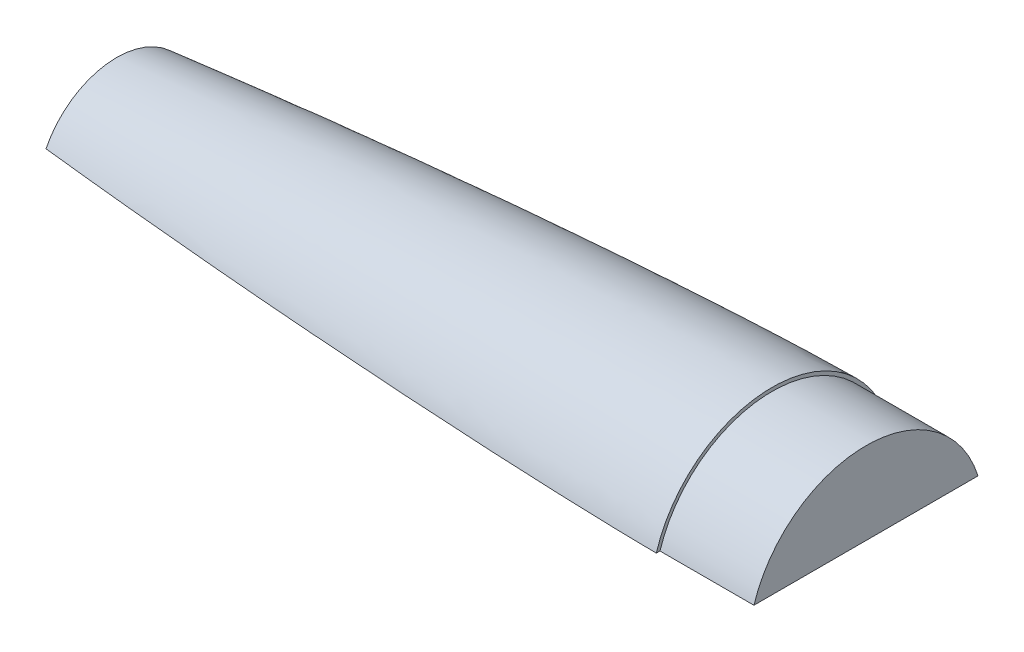
ISO-10303-21;
HEADER;
FILE_DESCRIPTION(('STEP AP214'),'2;1');
FILE_NAME('part.step','',(''),(''),'','','');
FILE_SCHEMA(('AUTOMOTIVE_DESIGN { 1 0 10303 214 1 1 1 1 }'));
ENDSEC;
DATA;
#1=APPLICATION_CONTEXT('core data for automotive mechanical design processes');
#2=APPLICATION_PROTOCOL_DEFINITION('international standard','automotive_design',2000,#1);
#3=PRODUCT_CONTEXT('',#1,'mechanical');
#4=PRODUCT('Part','Part','',(#3));
#5=PRODUCT_RELATED_PRODUCT_CATEGORY('part','',(#4));
#6=PRODUCT_DEFINITION_FORMATION('','',#4);
#7=PRODUCT_DEFINITION_CONTEXT('part definition',#1,'design');
#8=PRODUCT_DEFINITION('design','',#6,#7);
#9=PRODUCT_DEFINITION_SHAPE('','',#8);
#10=(LENGTH_UNIT() NAMED_UNIT(*) SI_UNIT(.MILLI.,.METRE.));
#11=(NAMED_UNIT(*) PLANE_ANGLE_UNIT() SI_UNIT($,.RADIAN.));
#12=(NAMED_UNIT(*) SI_UNIT($,.STERADIAN.) SOLID_ANGLE_UNIT());
#13=UNCERTAINTY_MEASURE_WITH_UNIT(LENGTH_MEASURE(1.E-05),#10,'distance_accuracy_value','');
#14=(GEOMETRIC_REPRESENTATION_CONTEXT(3) GLOBAL_UNCERTAINTY_ASSIGNED_CONTEXT((#13)) GLOBAL_UNIT_ASSIGNED_CONTEXT((#10,
#11,#12)) REPRESENTATION_CONTEXT('',''));
#15=CARTESIAN_POINT('',(0.,0.,0.));
#16=DIRECTION('',(0.,0.,1.));
#17=DIRECTION('',(1.,0.,0.));
#18=AXIS2_PLACEMENT_3D('',#15,#16,#17);
#19=CARTESIAN_POINT('',(685.8,63.5,0.));
#20=DIRECTION('',(-1.,0.,0.));
#21=DIRECTION('',(0.,0.,1.));
#22=AXIS2_PLACEMENT_3D('',#19,#20,#21);
#23=PLANE('',#22);
#24=DIRECTION('',(0.,0.,-1.));
#25=VECTOR('',#24,1.);
#26=CARTESIAN_POINT('',(685.8,19.05,0.));
#27=LINE('',#26,#25);
#28=CARTESIAN_POINT('',(685.8,19.05,60.5751392899761));
#29=VERTEX_POINT('',#28);
#30=CARTESIAN_POINT('',(685.8,19.05,-60.5751392899761));
#31=VERTEX_POINT('',#30);
#32=EDGE_CURVE('E80',#29,#31,#27,.T.);
#33=ORIENTED_EDGE('',*,*,#32,.T.);
#34=CARTESIAN_POINT('',(685.8,0.,0.));
#35=DIRECTION('',(-1.,0.,0.));
#36=DIRECTION('',(0.,0.,1.));
#37=AXIS2_PLACEMENT_3D('',#34,#35,#36);
#38=CIRCLE('',#37,63.5);
#39=EDGE_CURVE('E90',#29,#31,#38,.T.);
#40=ORIENTED_EDGE('',*,*,#39,.F.);
#41=EDGE_LOOP('',(#33,#40));
#42=FACE_BOUND('',#41,.T.);
#43=ADVANCED_FACE('F41',(#42),#23,.F.);
#44=CARTESIAN_POINT('',(0.,0.,0.));
#45=DIRECTION('',(-1.,0.,0.));
#46=DIRECTION('',(0.,0.,1.));
#47=AXIS2_PLACEMENT_3D('',#44,#45,#46);
#48=CYLINDRICAL_SURFACE('',#47,63.5);
#49=DIRECTION('',(-1.,0.,0.));
#50=VECTOR('',#49,1.);
#51=CARTESIAN_POINT('',(0.,19.05,60.5751392899761));
#52=LINE('',#51,#50);
#53=CARTESIAN_POINT('',(635.,19.05,60.5751392899761));
#54=VERTEX_POINT('',#53);
#55=EDGE_CURVE('E83',#29,#54,#52,.T.);
#56=ORIENTED_EDGE('',*,*,#55,.F.);
#57=ORIENTED_EDGE('',*,*,#39,.T.);
#58=DIRECTION('',(-1.,0.,0.));
#59=VECTOR('',#58,1.);
#60=CARTESIAN_POINT('',(0.,19.05,-60.5751392899761));
#61=LINE('',#60,#59);
#62=CARTESIAN_POINT('',(635.,19.05,-60.5751392899761));
#63=VERTEX_POINT('',#62);
#64=EDGE_CURVE('E86',#63,#31,#61,.F.);
#65=ORIENTED_EDGE('',*,*,#64,.F.);
#66=CARTESIAN_POINT('',(635.,0.,0.));
#67=DIRECTION('',(-1.,0.,0.));
#68=DIRECTION('',(0.,0.,1.));
#69=AXIS2_PLACEMENT_3D('',#66,#67,#68);
#70=CIRCLE('',#69,63.5);
#71=EDGE_CURVE('E96',#54,#63,#70,.T.);
#72=ORIENTED_EDGE('',*,*,#71,.F.);
#73=EDGE_LOOP('',(#56,#57,#65,#72));
#74=FACE_BOUND('',#73,.T.);
#75=ADVANCED_FACE('F94',(#74),#48,.T.);
#76=CARTESIAN_POINT('',(635.,63.5,0.));
#77=DIRECTION('',(-1.,0.,0.));
#78=DIRECTION('',(0.,0.,1.));
#79=AXIS2_PLACEMENT_3D('',#76,#77,#78);
#80=PLANE('',#79);
#81=DIRECTION('',(0.,0.,1.));
#82=VECTOR('',#81,1.);
#83=CARTESIAN_POINT('',(635.,19.05,0.));
#84=LINE('',#83,#82);
#85=CARTESIAN_POINT('',(635.,19.05,-62.5692538312549));
#86=VERTEX_POINT('',#85);
#87=EDGE_CURVE('E113',#86,#63,#84,.T.);
#88=ORIENTED_EDGE('',*,*,#87,.F.);
#89=CARTESIAN_POINT('',(635.,0.,0.));
#90=DIRECTION('',(-1.,0.,0.));
#91=DIRECTION('',(0.,0.,1.));
#92=AXIS2_PLACEMENT_3D('',#89,#90,#91);
#93=CIRCLE('',#92,65.405);
#94=CARTESIAN_POINT('',(635.,19.05,62.5692538312549));
#95=VERTEX_POINT('',#94);
#96=EDGE_CURVE('E53',#95,#86,#93,.T.);
#97=ORIENTED_EDGE('',*,*,#96,.F.);
#98=EDGE_CURVE('E97',#54,#95,#84,.T.);
#99=ORIENTED_EDGE('',*,*,#98,.F.);
#100=ORIENTED_EDGE('',*,*,#71,.T.);
#101=EDGE_LOOP('',(#88,#97,#99,#100));
#102=FACE_BOUND('',#101,.T.);
#103=ADVANCED_FACE('F120',(#102),#80,.F.);
#104=CARTESIAN_POINT('',(279.4,19.05,0.));
#105=DIRECTION('',(0.,-1.,0.));
#106=DIRECTION('',(0.,0.,-1.));
#107=AXIS2_PLACEMENT_3D('',#104,#105,#106);
#108=PLANE('',#107);
#109=DIRECTION('',(0.,0.,1.));
#110=VECTOR('',#109,1.);
#111=CARTESIAN_POINT('',(280.67,19.05,0.));
#112=LINE('',#111,#110);
#113=CARTESIAN_POINT('',(280.67,19.05,-38.2205203294032));
#114=VERTEX_POINT('',#113);
#115=CARTESIAN_POINT('',(280.67,19.05,38.2205203294032));
#116=VERTEX_POINT('',#115);
#117=EDGE_CURVE('E11',#114,#116,#112,.T.);
#118=ORIENTED_EDGE('',*,*,#117,.F.);
#119=CARTESIAN_POINT('',(279.4,19.05,-38.0787468146542));
#120=CARTESIAN_POINT('',(281.962941840319,19.05,-38.3653148698022));
#121=CARTESIAN_POINT('',(284.52619313829,19.05,-38.6491115880142));
#122=CARTESIAN_POINT('',(289.653293660425,19.05,-39.2113363491132));
#123=CARTESIAN_POINT('',(292.217142886666,19.05,-39.4897643730632));
#124=CARTESIAN_POINT('',(297.345408497432,19.05,-40.0414246180997));
#125=CARTESIAN_POINT('',(299.909824883765,19.05,-40.3146568223671));
#126=CARTESIAN_POINT('',(305.039196925893,19.05,-40.8560742741887));
#127=CARTESIAN_POINT('',(307.604152583049,19.05,-41.1242595088351));
#128=CARTESIAN_POINT('',(312.734576809965,19.05,-41.6557166548684));
#129=CARTESIAN_POINT('',(315.300045380515,19.05,-41.9189885586175));
#130=CARTESIAN_POINT('',(320.43256951596,19.05,-42.4408488164031));
#131=CARTESIAN_POINT('',(322.999625289811,19.05,-42.6994351150424));
#132=CARTESIAN_POINT('',(328.134202873585,19.05,-43.2119127435085));
#133=CARTESIAN_POINT('',(330.701724683053,19.05,-43.4658040778857));
#134=CARTESIAN_POINT('',(335.837212635562,19.05,-43.9689834624861));
#135=CARTESIAN_POINT('',(338.405178777453,19.05,-44.2182715244462));
#136=CARTESIAN_POINT('',(343.54153487725,19.05,-44.7123260708543));
#137=CARTESIAN_POINT('',(346.109924833278,19.05,-44.9570925748264));
#138=CARTESIAN_POINT('',(351.247108327983,19.05,-45.442174327989));
#139=CARTESIAN_POINT('',(353.815901864041,19.05,-45.6824896049671));
#140=CARTESIAN_POINT('',(363.787335485023,19.05,-46.6067575310501));
#141=CARTESIAN_POINT('',(371.19146531341,19.05,-47.2747110276422));
#142=CARTESIAN_POINT('',(386.002794445674,19.05,-48.5753703209046));
#143=CARTESIAN_POINT('',(393.409993741409,19.05,-49.2080762104911));
#144=CARTESIAN_POINT('',(408.227377777448,19.05,-50.4388371668362));
#145=CARTESIAN_POINT('',(415.637562558885,19.05,-51.0368917385027));
#146=CARTESIAN_POINT('',(430.460863850272,19.05,-52.1984595248306));
#147=CARTESIAN_POINT('',(437.873980441993,19.05,-52.7619716959195));
#148=CARTESIAN_POINT('',(452.703129718263,19.05,-53.8541035393644));
#149=CARTESIAN_POINT('',(460.119162522014,19.05,-54.3827215937465));
#150=CARTESIAN_POINT('',(474.954170880049,19.05,-55.4041802346604));
#151=CARTESIAN_POINT('',(482.373146592318,19.05,-55.8970185287863));
#152=CARTESIAN_POINT('',(497.210334993728,19.05,-56.8451778325824));
#153=CARTESIAN_POINT('',(504.628546670283,19.05,-57.3005146767645));
#154=CARTESIAN_POINT('',(519.467360795622,19.05,-58.1715988116425));
#155=CARTESIAN_POINT('',(526.887963262055,19.05,-58.5873458030278));
#156=CARTESIAN_POINT('',(538.020452451662,19.05,-59.1787057100789));
#157=CARTESIAN_POINT('',(541.731487214648,19.05,-59.3704461142135));
#158=CARTESIAN_POINT('',(549.154126587857,19.05,-59.742543753956));
#159=CARTESIAN_POINT('',(552.865731197695,19.05,-59.9229009972155));
#160=CARTESIAN_POINT('',(560.289270654327,19.05,-60.2714807123018));
#161=CARTESIAN_POINT('',(564.001205464342,19.05,-60.4397039666133));
#162=CARTESIAN_POINT('',(571.425640172957,19.05,-60.7631374828902));
#163=CARTESIAN_POINT('',(575.13814007106,19.05,-60.918347756244));
#164=CARTESIAN_POINT('',(582.563415939562,19.05,-61.2144839827638));
#165=CARTESIAN_POINT('',(586.276191864725,19.05,-61.3554110676676));
#166=CARTESIAN_POINT('',(593.702334555381,19.05,-61.621256096151));
#167=CARTESIAN_POINT('',(597.415701322829,19.05,-61.7461739856221));
#168=CARTESIAN_POINT('',(602.986120615846,19.05,-61.9196907560125));
#169=CARTESIAN_POINT('',(604.842958597213,19.05,-61.9752188844349));
#170=CARTESIAN_POINT('',(608.556780664078,19.05,-62.0812314908967));
#171=CARTESIAN_POINT('',(610.413764749675,19.05,-62.1317159655404));
#172=CARTESIAN_POINT('',(614.127867626814,19.05,-62.2269513241083));
#173=CARTESIAN_POINT('',(615.984986417346,19.05,-62.2717022473751));
#174=CARTESIAN_POINT('',(619.699371030722,19.05,-62.354555813422));
#175=CARTESIAN_POINT('',(621.556636853268,19.05,-62.3926584693033));
#176=CARTESIAN_POINT('',(624.057582839542,19.05,-62.4385699348673));
#177=CARTESIAN_POINT('',(624.701199008142,19.05,-62.4499039832551));
#178=CARTESIAN_POINT('',(625.988449363352,19.05,-62.4715207063014));
#179=CARTESIAN_POINT('',(626.63208354997,19.05,-62.4818033805221));
#180=CARTESIAN_POINT('',(627.919367879378,19.05,-62.5012377844219));
#181=CARTESIAN_POINT('',(628.563018022136,19.05,-62.5103895162302));
#182=CARTESIAN_POINT('',(629.850348049547,19.05,-62.5273219164161));
#183=CARTESIAN_POINT('',(630.494027934528,19.05,-62.5351025601207));
#184=CARTESIAN_POINT('',(631.781409150107,19.05,-62.5488353621133));
#185=CARTESIAN_POINT('',(632.425110480738,19.05,-62.5547875177062));
#186=CARTESIAN_POINT('',(633.712538585411,19.05,-62.5641277274002));
#187=CARTESIAN_POINT('',(634.35626535966,19.05,-62.5675157523067));
#188=CARTESIAN_POINT('',(635.,19.05,-62.5692538312549));
#189=B_SPLINE_CURVE_WITH_KNOTS('',3,(#119,#120,#121,#122,#123,#124,#125,#126,#127,#128,#129,
#130,#131,#132,#133,#134,#135,#136,#137,#138,#139,#140,#141,#142,#143,#144,#145,#146,#147,#148,
#149,#150,#151,#152,#153,#154,#155,#156,#157,#158,#159,#160,#161,#162,#163,#164,#165,#166,#167,
#168,#169,#170,#171,#172,#173,#174,#175,#176,#177,#178,#179,#180,#181,#182,#183,#184,#185,#186,
#187,#188),.UNSPECIFIED.,.F.,.F.,(4,2,2,2,2,2,2,2,2,2,2,2,2,2,2,2,2,2,2,2,2,2,2,2,2,2,2,2,2,2,2,
2,2,2,4),(0.,7.73673681385579,15.4735009123669,23.21029005076,30.9470989733787,38.6839199218791,
46.4240563443367,54.1641852648212,61.9042944476294,69.644370200718,77.3843976186842,
99.6868940302174,121.989331647435,144.292087839578,166.595517496405,188.899980595587,
211.205871480887,233.502295178368,255.798887429798,266.946827872439,278.094760821598,
289.241974230058,300.389177882956,311.535497588225,322.68185496525,328.254853754648,
333.827856296046,339.400820594261,344.973773910144,346.904921137579,348.836069169189,
350.76721356502,352.698392708733,354.629574698889,356.560778676705),.UNSPECIFIED.);
#190=EDGE_CURVE('E100',#114,#86,#189,.T.);
#191=ORIENTED_EDGE('',*,*,#190,.T.);
#192=ORIENTED_EDGE('',*,*,#87,.T.);
#193=ORIENTED_EDGE('',*,*,#64,.T.);
#194=ORIENTED_EDGE('',*,*,#32,.F.);
#195=ORIENTED_EDGE('',*,*,#55,.T.);
#196=ORIENTED_EDGE('',*,*,#98,.T.);
#197=CARTESIAN_POINT('',(635.,19.05,62.5692538312549));
#198=CARTESIAN_POINT('',(634.557083179845,19.05,62.5680767826086));
#199=CARTESIAN_POINT('',(634.114169421304,19.05,62.5660986686463));
#200=CARTESIAN_POINT('',(633.228351154422,19.05,62.560809869688));
#201=CARTESIAN_POINT('',(632.785446646055,19.05,62.5574991889919));
#202=CARTESIAN_POINT('',(631.899650280562,19.05,62.5498148322637));
#203=CARTESIAN_POINT('',(631.456758423368,19.05,62.5454411637499));
#204=CARTESIAN_POINT('',(630.570983736824,19.05,62.5358329386729));
#205=CARTESIAN_POINT('',(630.128100907483,19.05,62.5305983812942));
#206=CARTESIAN_POINT('',(628.799477875779,19.05,62.5138639281902));
#207=CARTESIAN_POINT('',(627.913750667544,19.05,62.5013331332159));
#208=CARTESIAN_POINT('',(626.142326879892,19.05,62.4741747973506));
#209=CARTESIAN_POINT('',(625.25663030055,19.05,62.4595472516271));
#210=CARTESIAN_POINT('',(623.485389258979,19.05,62.4283808178204));
#211=CARTESIAN_POINT('',(622.599844792244,19.05,62.4118421855351));
#212=CARTESIAN_POINT('',(620.828790528943,19.05,62.3770503013291));
#213=CARTESIAN_POINT('',(619.943280732345,19.05,62.3587970510382));
#214=CARTESIAN_POINT('',(618.172291265358,19.05,62.3207164999407));
#215=CARTESIAN_POINT('',(617.286811595114,19.05,62.3008891924402));
#216=CARTESIAN_POINT('',(615.515885990744,19.05,62.259774947519));
#217=CARTESIAN_POINT('',(614.630440056629,19.05,62.238488009652));
#218=CARTESIAN_POINT('',(611.974242706356,19.05,62.1725974546183));
#219=CARTESIAN_POINT('',(610.203541442275,19.05,62.1259621324541));
#220=CARTESIAN_POINT('',(606.662274168222,19.05,62.0279383029123));
#221=CARTESIAN_POINT('',(604.891708158041,19.05,61.9765498030317));
#222=CARTESIAN_POINT('',(601.350743528165,19.05,61.8694531172705));
#223=CARTESIAN_POINT('',(599.580344905765,19.05,61.8137450207067));
#224=CARTESIAN_POINT('',(596.039678709525,19.05,61.6982995917104));
#225=CARTESIAN_POINT('',(594.269411135742,19.05,61.6385622574739));
#226=CARTESIAN_POINT('',(588.958832941105,19.05,61.4537209635159));
#227=CARTESIAN_POINT('',(585.418717263048,19.05,61.3229868084328));
#228=CARTESIAN_POINT('',(578.339008161098,19.05,61.048166911052));
#229=CARTESIAN_POINT('',(574.799414737096,19.05,60.9040811715536));
#230=CARTESIAN_POINT('',(567.722055004188,19.05,60.6038118103173));
#231=CARTESIAN_POINT('',(564.184288504082,19.05,60.447632688559));
#232=CARTESIAN_POINT('',(557.109221125926,19.05,60.1239883189603));
#233=CARTESIAN_POINT('',(553.571920255397,19.05,59.9565229070085));
#234=CARTESIAN_POINT('',(546.497787442321,19.05,59.6109882512868));
#235=CARTESIAN_POINT('',(542.960955507027,19.05,59.432918859197));
#236=CARTESIAN_POINT('',(535.887769373245,19.05,59.0667591265992));
#237=CARTESIAN_POINT('',(532.351415180843,19.05,58.87866866864));
#238=CARTESIAN_POINT('',(525.27919904998,19.05,58.4929329639595));
#239=CARTESIAN_POINT('',(521.743337115793,19.05,58.2952876388972));
#240=CARTESIAN_POINT('',(514.672126718114,19.05,57.8908005452011));
#241=CARTESIAN_POINT('',(511.136778256624,19.05,57.683958741618));
#242=CARTESIAN_POINT('',(501.252575340419,19.05,57.0932098486804));
#243=CARTESIAN_POINT('',(494.904309186183,19.05,56.6994217039673));
#244=CARTESIAN_POINT('',(482.209563920437,19.05,55.8846097770443));
#245=CARTESIAN_POINT('',(475.863084799341,19.05,55.4635861438301));
#246=CARTESIAN_POINT('',(463.171945752883,19.05,54.5952396969018));
#247=CARTESIAN_POINT('',(456.827285822055,19.05,54.147916963069));
#248=CARTESIAN_POINT('',(444.139844338276,19.05,53.2275954197846));
#249=CARTESIAN_POINT('',(437.797062780914,19.05,52.7545966711102));
#250=CARTESIAN_POINT('',(425.113458840649,19.05,51.783235297827));
#251=CARTESIAN_POINT('',(418.772636452714,19.05,51.2848727389004));
#252=CARTESIAN_POINT('',(406.093049443961,19.05,50.2628550432351));
#253=CARTESIAN_POINT('',(399.75428481702,19.05,49.7391999824598));
#254=CARTESIAN_POINT('',(387.07478968228,19.05,48.6660594817229));
#255=CARTESIAN_POINT('',(380.734060577327,19.05,48.1165574630799));
#256=CARTESIAN_POINT('',(368.054906518241,19.05,46.9915859588312));
#257=CARTESIAN_POINT('',(361.716481563774,19.05,46.4161164769912));
#258=CARTESIAN_POINT('',(349.042110940092,19.05,45.2384644796371));
#259=CARTESIAN_POINT('',(342.706165271371,19.05,44.6362819588045));
#260=CARTESIAN_POINT('',(330.036960381976,19.05,43.404141977232));
#261=CARTESIAN_POINT('',(323.703701167128,19.05,42.7741844565586));
#262=CARTESIAN_POINT('',(311.040107738277,19.05,41.4850540973945));
#263=CARTESIAN_POINT('',(304.70977354438,19.05,40.8258810610177));
#264=CARTESIAN_POINT('',(295.216720428929,19.05,39.8137313384992));
#265=CARTESIAN_POINT('',(292.052751964166,19.05,39.4724468953571));
#266=CARTESIAN_POINT('',(285.725699182497,19.05,38.781762990172));
#267=CARTESIAN_POINT('',(282.562614866106,19.05,38.4323635234241));
#268=CARTESIAN_POINT('',(279.4,19.05,38.0787468146542));
#269=B_SPLINE_CURVE_WITH_KNOTS('',3,(#197,#198,#199,#200,#201,#202,#203,#204,#205,#206,#207,
#208,#209,#210,#211,#212,#213,#214,#215,#216,#217,#218,#219,#220,#221,#222,#223,#224,#225,#226,
#227,#228,#229,#230,#231,#232,#233,#234,#235,#236,#237,#238,#239,#240,#241,#242,#243,#244,#245,
#246,#247,#248,#249,#250,#251,#252,#253,#254,#255,#256,#257,#258,#259,#260,#261,#262,#263,#264,
#265,#266,#267,#268),.UNSPECIFIED.,.F.,.F.,(4,2,2,2,2,2,2,2,2,2,2,2,2,2,2,2,2,2,2,2,2,2,2,2,2,2,
2,2,2,2,2,2,2,2,2,4),(0.,1.32875308336991,2.65750187917886,3.9862412772529,5.31498193432484,
7.9724258603973,10.6298759114645,13.2869706753201,15.9440629134963,18.6011664518955,
21.2582708026172,26.5722085412447,31.8861378985374,37.1999574084738,42.5137792975913,
53.1413342834106,63.7688870411195,74.3925040882581,85.0162756443196,95.6401958320734,
106.264240564313,116.888372418841,127.512544651849,146.593881516027,165.675114001854,
184.756288533086,203.837417899639,222.918497856158,241.999520508167,261.092953547841,
280.186383818608,299.279817890864,318.373293165454,337.466897786137,347.013853776057,
356.560815301113),.UNSPECIFIED.);
#270=EDGE_CURVE('E122',#95,#116,#269,.T.);
#271=ORIENTED_EDGE('',*,*,#270,.T.);
#272=EDGE_LOOP('',(#118,#191,#192,#193,#194,#195,#196,#271));
#273=FACE_BOUND('',#272,.T.);
#274=ADVANCED_FACE('F82',(#273),#108,.T.);
#275=CARTESIAN_POINT('',(635.,65.405,0.));
#276=CARTESIAN_POINT('',(632.980968041376,65.3999049079982,0.));
#277=CARTESIAN_POINT('',(628.943051518666,65.3607987649682,0.));
#278=CARTESIAN_POINT('',(620.867800743739,65.238425835158,0.));
#279=CARTESIAN_POINT('',(607.876612197197,64.9420444267635,0.));
#280=CARTESIAN_POINT('',(591.989866173885,64.4665825864284,0.));
#281=CARTESIAN_POINT('',(568.294487812533,63.5924578117391,0.));
#282=CARTESIAN_POINT('',(538.814064527861,62.2664605978091,0.));
#283=CARTESIAN_POINT('',(504.434100625351,60.4361863708921,0.));
#284=CARTESIAN_POINT('',(465.161890456531,58.0127528854532,0.));
#285=CARTESIAN_POINT('',(425.909385737502,55.2895252497301,0.));
#286=CARTESIAN_POINT('',(386.677550901074,52.2836135264071,0.));
#287=CARTESIAN_POINT('',(347.46776242828,49.0025673324941,0.));
#288=CARTESIAN_POINT('',(308.282068325667,45.4454012222465,0.));
#289=CARTESIAN_POINT('',(269.123174714222,41.6037605555624,0.));
#290=CARTESIAN_POINT('',(229.995170684784,37.4592339547084,0.));
#291=CARTESIAN_POINT('',(190.90356887878,32.9826992551564,0.));
#292=CARTESIAN_POINT('',(151.857530337521,28.1241973222402,0.));
#293=CARTESIAN_POINT('',(112.870807325211,22.8061369351955,0.));
#294=CARTESIAN_POINT('',(77.9573287846358,17.4873019784259,0.));
#295=CARTESIAN_POINT('',(49.1787935546804,12.5135793040533,0.));
#296=CARTESIAN_POINT('',(28.2617417770008,8.30499279351691,0.));
#297=CARTESIAN_POINT('',(16.0220282949449,5.44625020056791,0.));
#298=CARTESIAN_POINT('',(8.93318062814798,3.51548578780447,0.));
#299=CARTESIAN_POINT('',(5.16339541485639,2.32840347516785,0.));
#300=CARTESIAN_POINT('',(3.11582679923173,1.59218900684347,0.));
#301=CARTESIAN_POINT('',(1.97027691704133,1.1275016191836,0.));
#302=CARTESIAN_POINT('',(1.33181141167439,0.839140676757945,0.));
#303=CARTESIAN_POINT('',(0.95671602904962,0.653660621097922,0.));
#304=CARTESIAN_POINT('',(0.715531562152649,0.525146597932932,0.));
#305=CARTESIAN_POINT('',(0.550210431495335,0.431764809009291,0.));
#306=CARTESIAN_POINT('',(0.406270251751136,0.344359984283262,0.));
#307=CARTESIAN_POINT('',(0.283649615611126,0.263361482709997,0.));
#308=CARTESIAN_POINT('',(0.181602895816827,0.18888943286587,0.));
#309=CARTESIAN_POINT('',(0.109817079168359,0.130424863371353,0.));
#310=CARTESIAN_POINT('',(0.0569836765196351,0.0804262546774983,0.));
#311=CARTESIAN_POINT('',(0.0222716682134025,0.0403845586316774,0.));
#312=CARTESIAN_POINT('',(0.00752296936524731,0.0183675987536798,0.));
#313=CARTESIAN_POINT('',(0.00219211488346488,0.0062902080222314,0.));
#314=CARTESIAN_POINT('',(0.,0.,0.));
#315=B_SPLINE_CURVE_WITH_KNOTS('',4,(#275,#276,#277,#278,#279,#280,#281,#282,#283,#284,#285,
#286,#287,#288,#289,#290,#291,#292,#293,#294,#295,#296,#297,#298,#299,#300,#301,#302,#303,#304,
#305,#306,#307,#308,#309,#310,#311,#312,#313,#314),.UNSPECIFIED.,.F.,.F.,(5,1,1,1,1,1,1,1,1,1,1,
1,1,1,1,1,1,1,1,1,1,1,1,1,1,1,1,1,1,1,1,1,1,1,1,1,5),(0.,0.0126278600836156,0.0252557201672313,
0.0505114403344626,0.0812725997628029,0.112033759191143,0.173556078208551,0.235078396298971,
0.296600715210933,0.358123034494872,0.419645352372099,0.481167670690979,0.542689989321029,
0.604212308113024,0.665734626856386,0.727256945203041,0.788779262537685,0.850301578000527,
0.911823895791277,0.948128969524394,0.971421118017023,0.983729988096585,0.990421707276453,
0.994070390445943,0.996134035175531,0.997335608030765,0.998151497389768,0.998451073952135,
0.998750650514502,0.999044750264593,0.999338850014684,0.999504137511013,0.999669425007342,
0.999834712503671,0.999917356251836,0.999958678125918,1.),.UNSPECIFIED.);
#316=CARTESIAN_POINT('',(0.,0.,0.));
#317=DIRECTION('',(-1.,0.,0.));
#318=AXIS1_PLACEMENT('',#316,#317);
#319=SURFACE_OF_REVOLUTION('',#315,#318);
#320=ORIENTED_EDGE('',*,*,#190,.F.);
#321=CARTESIAN_POINT('',(280.67,0.,0.));
#322=DIRECTION('',(-1.,0.,0.));
#323=DIRECTION('',(0.,0.,1.));
#324=AXIS2_PLACEMENT_3D('',#321,#322,#323);
#325=CIRCLE('',#324,42.7049256438918);
#326=EDGE_CURVE('E59',#114,#116,#325,.F.);
#327=ORIENTED_EDGE('',*,*,#326,.T.);
#328=ORIENTED_EDGE('',*,*,#270,.F.);
#329=ORIENTED_EDGE('',*,*,#96,.T.);
#330=EDGE_LOOP('',(#320,#327,#328,#329));
#331=FACE_BOUND('',#330,.T.);
#332=ADVANCED_FACE('F115',(#331),#319,.T.);
#333=CARTESIAN_POINT('',(280.67,63.5,-74.1707889802868));
#334=DIRECTION('',(1.,0.,0.));
#335=DIRECTION('',(0.,0.,-1.));
#336=AXIS2_PLACEMENT_3D('',#333,#334,#335);
#337=PLANE('',#336);
#338=ORIENTED_EDGE('',*,*,#117,.T.);
#339=ORIENTED_EDGE('',*,*,#326,.F.);
#340=EDGE_LOOP('',(#338,#339));
#341=FACE_BOUND('',#340,.T.);
#342=ADVANCED_FACE('F43',(#341),#337,.F.);
#343=CLOSED_SHELL('',(#43,#75,#103,#274,#332,#342));
#344=MANIFOLD_SOLID_BREP('B2',#343);
#345=ADVANCED_BREP_SHAPE_REPRESENTATION('',(#18,#344),#14);
#346=SHAPE_DEFINITION_REPRESENTATION(#9,#345);
ENDSEC;
END-ISO-10303-21;
